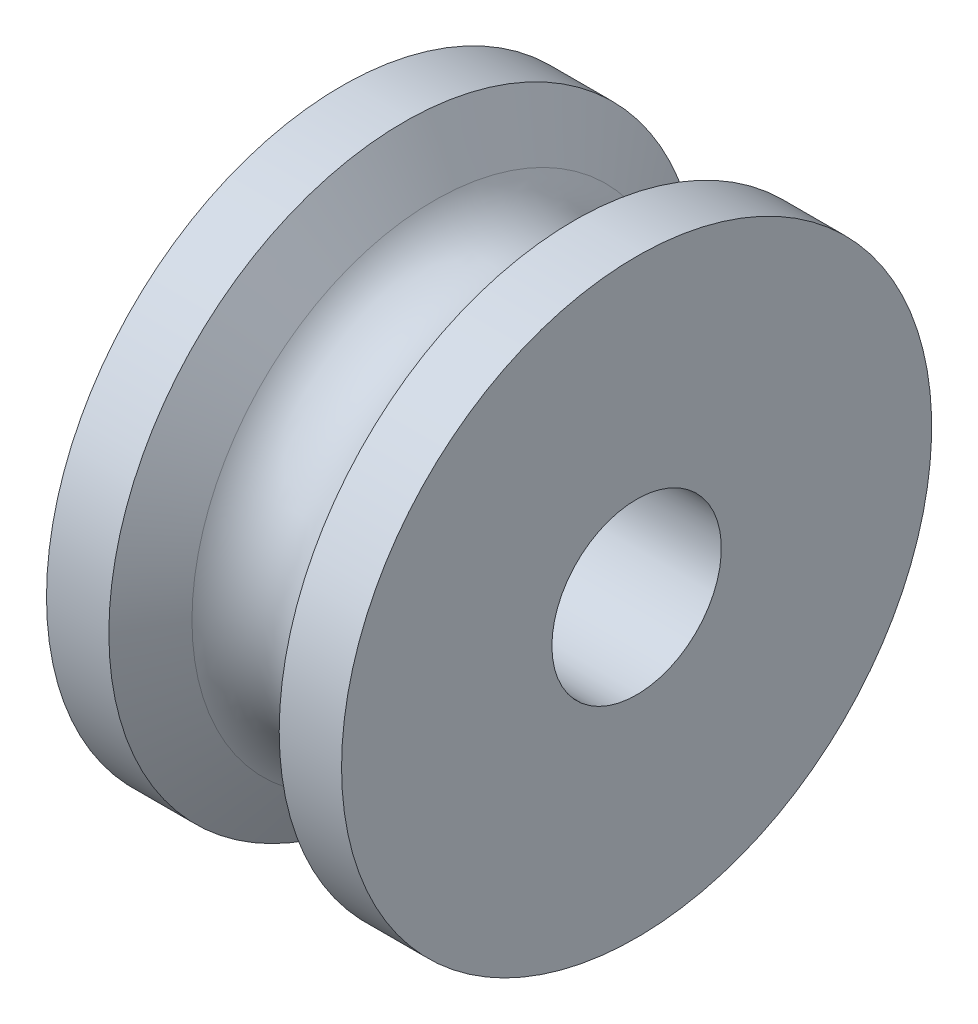
ISO-10303-21;
HEADER;
FILE_DESCRIPTION(('STEP AP214'),'2;1');
FILE_NAME('part.step','',(''),(''),'','','');
FILE_SCHEMA(('AUTOMOTIVE_DESIGN { 1 0 10303 214 1 1 1 1 }'));
ENDSEC;
DATA;
#1=APPLICATION_CONTEXT('core data for automotive mechanical design processes');
#2=APPLICATION_PROTOCOL_DEFINITION('international standard','automotive_design',2000,#1);
#3=PRODUCT_CONTEXT('',#1,'mechanical');
#4=PRODUCT('Part','Part','',(#3));
#5=PRODUCT_RELATED_PRODUCT_CATEGORY('part','',(#4));
#6=PRODUCT_DEFINITION_FORMATION('','',#4);
#7=PRODUCT_DEFINITION_CONTEXT('part definition',#1,'design');
#8=PRODUCT_DEFINITION('design','',#6,#7);
#9=PRODUCT_DEFINITION_SHAPE('','',#8);
#10=(LENGTH_UNIT() NAMED_UNIT(*) SI_UNIT(.MILLI.,.METRE.));
#11=(NAMED_UNIT(*) PLANE_ANGLE_UNIT() SI_UNIT($,.RADIAN.));
#12=(NAMED_UNIT(*) SI_UNIT($,.STERADIAN.) SOLID_ANGLE_UNIT());
#13=UNCERTAINTY_MEASURE_WITH_UNIT(LENGTH_MEASURE(1.E-05),#10,'distance_accuracy_value','');
#14=(GEOMETRIC_REPRESENTATION_CONTEXT(3) GLOBAL_UNCERTAINTY_ASSIGNED_CONTEXT((#13)) GLOBAL_UNIT_ASSIGNED_CONTEXT((#10,
#11,#12)) REPRESENTATION_CONTEXT('',''));
#15=CARTESIAN_POINT('',(0.,0.,0.));
#16=DIRECTION('',(0.,0.,1.));
#17=DIRECTION('',(1.,0.,0.));
#18=AXIS2_PLACEMENT_3D('',#15,#16,#17);
#19=CARTESIAN_POINT('',(0.,8.89,0.));
#20=DIRECTION('',(1.,0.,0.));
#21=DIRECTION('',(0.,0.,-1.));
#22=AXIS2_PLACEMENT_3D('',#19,#20,#21);
#23=PLANE('',#22);
#24=CARTESIAN_POINT('',(0.,0.,0.));
#25=DIRECTION('',(-1.,0.,0.));
#26=DIRECTION('',(0.,0.,1.));
#27=AXIS2_PLACEMENT_3D('',#24,#25,#26);
#28=CIRCLE('',#27,2.5527);
#29=CARTESIAN_POINT('',(0.,0.,2.5527));
#30=VERTEX_POINT('',#29);
#31=EDGE_CURVE('E79',#30,#30,#28,.T.);
#32=ORIENTED_EDGE('',*,*,#31,.F.);
#33=EDGE_LOOP('',(#32));
#34=FACE_BOUND('',#33,.T.);
#35=CARTESIAN_POINT('',(0.,0.,0.));
#36=DIRECTION('',(-1.,0.,0.));
#37=DIRECTION('',(0.,0.,1.));
#38=AXIS2_PLACEMENT_3D('',#35,#36,#37);
#39=CIRCLE('',#38,8.89);
#40=CARTESIAN_POINT('',(0.,0.,8.89));
#41=VERTEX_POINT('',#40);
#42=EDGE_CURVE('E10',#41,#41,#39,.T.);
#43=ORIENTED_EDGE('',*,*,#42,.T.);
#44=EDGE_LOOP('',(#43));
#45=FACE_BOUND('',#44,.T.);
#46=ADVANCED_FACE('F43',(#34,#45),#23,.F.);
#47=CARTESIAN_POINT('',(0.,0.,0.));
#48=DIRECTION('',(-1.,0.,0.));
#49=DIRECTION('',(0.,0.,1.));
#50=AXIS2_PLACEMENT_3D('',#47,#48,#49);
#51=CYLINDRICAL_SURFACE('',#50,8.89);
#52=ORIENTED_EDGE('',*,*,#42,.F.);
#53=EDGE_LOOP('',(#52));
#54=FACE_BOUND('',#53,.T.);
#55=CARTESIAN_POINT('',(1.87867805345212,0.,0.));
#56=DIRECTION('',(-1.,0.,0.));
#57=DIRECTION('',(0.,0.,1.));
#58=AXIS2_PLACEMENT_3D('',#55,#56,#57);
#59=CIRCLE('',#58,8.89);
#60=CARTESIAN_POINT('',(1.87867805345212,0.,8.89));
#61=VERTEX_POINT('',#60);
#62=EDGE_CURVE('E50',#61,#61,#59,.T.);
#63=ORIENTED_EDGE('',*,*,#62,.T.);
#64=EDGE_LOOP('',(#63));
#65=FACE_BOUND('',#64,.T.);
#66=ADVANCED_FACE('F86',(#54,#65),#51,.T.);
#67=CARTESIAN_POINT('',(2.79522160579064,0.,0.));
#68=DIRECTION('',(-1.,0.,0.));
#69=DIRECTION('',(0.,0.,1.));
#70=AXIS2_PLACEMENT_3D('',#67,#68,#69);
#71=CONICAL_SURFACE('',#70,7.3025,1.0471975511966);
#72=ORIENTED_EDGE('',*,*,#62,.F.);
#73=EDGE_LOOP('',(#72));
#74=FACE_BOUND('',#73,.T.);
#75=CARTESIAN_POINT('',(2.79522160579064,0.,0.));
#76=DIRECTION('',(-1.,0.,0.));
#77=DIRECTION('',(0.,0.,1.));
#78=AXIS2_PLACEMENT_3D('',#75,#76,#77);
#79=CIRCLE('',#78,7.3025);
#80=CARTESIAN_POINT('',(2.79522160579064,0.,7.3025));
#81=VERTEX_POINT('',#80);
#82=EDGE_CURVE('E56',#81,#81,#79,.T.);
#83=ORIENTED_EDGE('',*,*,#82,.T.);
#84=EDGE_LOOP('',(#83));
#85=FACE_BOUND('',#84,.T.);
#86=ADVANCED_FACE('F91',(#74,#85),#71,.T.);
#87=CARTESIAN_POINT('',(4.445,0.,0.));
#88=DIRECTION('',(-1.,0.,0.));
#89=DIRECTION('',(0.,0.,1.));
#90=AXIS2_PLACEMENT_3D('',#87,#88,#89);
#91=TOROIDAL_SURFACE('',#90,8.255,1.905);
#92=ORIENTED_EDGE('',*,*,#82,.F.);
#93=EDGE_LOOP('',(#92));
#94=FACE_BOUND('',#93,.T.);
#95=CARTESIAN_POINT('',(6.09477839420936,0.,0.));
#96=DIRECTION('',(-1.,0.,0.));
#97=DIRECTION('',(0.,0.,1.));
#98=AXIS2_PLACEMENT_3D('',#95,#96,#97);
#99=CIRCLE('',#98,7.3025);
#100=CARTESIAN_POINT('',(6.09477839420936,0.,7.3025));
#101=VERTEX_POINT('',#100);
#102=EDGE_CURVE('E61',#101,#101,#99,.T.);
#103=ORIENTED_EDGE('',*,*,#102,.T.);
#104=EDGE_LOOP('',(#103));
#105=FACE_BOUND('',#104,.T.);
#106=ADVANCED_FACE('F95',(#94,#105),#91,.F.);
#107=CARTESIAN_POINT('',(7.01132194654788,0.,0.));
#108=DIRECTION('',(1.,0.,0.));
#109=DIRECTION('',(0.,0.,-1.));
#110=AXIS2_PLACEMENT_3D('',#107,#108,#109);
#111=CONICAL_SURFACE('',#110,8.89,1.0471975511966);
#112=ORIENTED_EDGE('',*,*,#102,.F.);
#113=EDGE_LOOP('',(#112));
#114=FACE_BOUND('',#113,.T.);
#115=CARTESIAN_POINT('',(7.01132194654788,0.,0.));
#116=DIRECTION('',(-1.,0.,0.));
#117=DIRECTION('',(0.,0.,1.));
#118=AXIS2_PLACEMENT_3D('',#115,#116,#117);
#119=CIRCLE('',#118,8.89);
#120=CARTESIAN_POINT('',(7.01132194654788,0.,8.89));
#121=VERTEX_POINT('',#120);
#122=EDGE_CURVE('E67',#121,#121,#119,.T.);
#123=ORIENTED_EDGE('',*,*,#122,.T.);
#124=EDGE_LOOP('',(#123));
#125=FACE_BOUND('',#124,.T.);
#126=ADVANCED_FACE('F100',(#114,#125),#111,.T.);
#127=CARTESIAN_POINT('',(0.,0.,0.));
#128=DIRECTION('',(-1.,0.,0.));
#129=DIRECTION('',(0.,0.,1.));
#130=AXIS2_PLACEMENT_3D('',#127,#128,#129);
#131=CYLINDRICAL_SURFACE('',#130,8.89);
#132=ORIENTED_EDGE('',*,*,#122,.F.);
#133=EDGE_LOOP('',(#132));
#134=FACE_BOUND('',#133,.T.);
#135=CARTESIAN_POINT('',(8.89,0.,0.));
#136=DIRECTION('',(-1.,0.,0.));
#137=DIRECTION('',(0.,0.,1.));
#138=AXIS2_PLACEMENT_3D('',#135,#136,#137);
#139=CIRCLE('',#138,8.89);
#140=CARTESIAN_POINT('',(8.89,0.,8.89));
#141=VERTEX_POINT('',#140);
#142=EDGE_CURVE('E71',#141,#141,#139,.T.);
#143=ORIENTED_EDGE('',*,*,#142,.T.);
#144=EDGE_LOOP('',(#143));
#145=FACE_BOUND('',#144,.T.);
#146=ADVANCED_FACE('F104',(#134,#145),#131,.T.);
#147=CARTESIAN_POINT('',(8.89,2.5527,0.));
#148=DIRECTION('',(-1.,0.,0.));
#149=DIRECTION('',(0.,0.,1.));
#150=AXIS2_PLACEMENT_3D('',#147,#148,#149);
#151=PLANE('',#150);
#152=ORIENTED_EDGE('',*,*,#142,.F.);
#153=EDGE_LOOP('',(#152));
#154=FACE_BOUND('',#153,.T.);
#155=CARTESIAN_POINT('',(8.89,0.,0.));
#156=DIRECTION('',(-1.,0.,0.));
#157=DIRECTION('',(0.,0.,1.));
#158=AXIS2_PLACEMENT_3D('',#155,#156,#157);
#159=CIRCLE('',#158,2.5527);
#160=CARTESIAN_POINT('',(8.89,0.,2.5527));
#161=VERTEX_POINT('',#160);
#162=EDGE_CURVE('E75',#161,#161,#159,.T.);
#163=ORIENTED_EDGE('',*,*,#162,.T.);
#164=EDGE_LOOP('',(#163));
#165=FACE_BOUND('',#164,.T.);
#166=ADVANCED_FACE('F107',(#154,#165),#151,.F.);
#167=CARTESIAN_POINT('',(0.,0.,0.));
#168=DIRECTION('',(-1.,0.,0.));
#169=DIRECTION('',(0.,0.,1.));
#170=AXIS2_PLACEMENT_3D('',#167,#168,#169);
#171=CYLINDRICAL_SURFACE('',#170,2.5527);
#172=ORIENTED_EDGE('',*,*,#162,.F.);
#173=EDGE_LOOP('',(#172));
#174=FACE_BOUND('',#173,.T.);
#175=ORIENTED_EDGE('',*,*,#31,.T.);
#176=EDGE_LOOP('',(#175));
#177=FACE_BOUND('',#176,.T.);
#178=ADVANCED_FACE('F83',(#174,#177),#171,.F.);
#179=CLOSED_SHELL('',(#46,#66,#86,#106,#126,#146,#166,#178));
#180=MANIFOLD_SOLID_BREP('B2',#179);
#181=ADVANCED_BREP_SHAPE_REPRESENTATION('',(#18,#180),#14);
#182=SHAPE_DEFINITION_REPRESENTATION(#9,#181);
ENDSEC;
END-ISO-10303-21;
